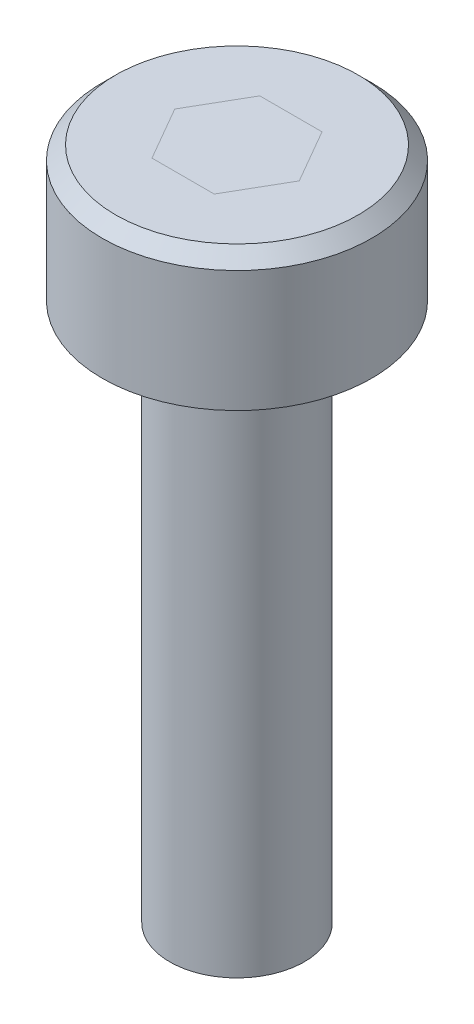
ISO-10303-21;
HEADER;
FILE_DESCRIPTION(('STEP AP214'),'2;1');
FILE_NAME('part.step','',(''),(''),'','','');
FILE_SCHEMA(('AUTOMOTIVE_DESIGN { 1 0 10303 214 1 1 1 1 }'));
ENDSEC;
DATA;
#1=APPLICATION_CONTEXT('core data for automotive mechanical design processes');
#2=APPLICATION_PROTOCOL_DEFINITION('international standard','automotive_design',2000,#1);
#3=PRODUCT_CONTEXT('',#1,'mechanical');
#4=PRODUCT('Part','Part','',(#3));
#5=PRODUCT_RELATED_PRODUCT_CATEGORY('part','',(#4));
#6=PRODUCT_DEFINITION_FORMATION('','',#4);
#7=PRODUCT_DEFINITION_CONTEXT('part definition',#1,'design');
#8=PRODUCT_DEFINITION('design','',#6,#7);
#9=PRODUCT_DEFINITION_SHAPE('','',#8);
#10=(LENGTH_UNIT() NAMED_UNIT(*) SI_UNIT(.MILLI.,.METRE.));
#11=(NAMED_UNIT(*) PLANE_ANGLE_UNIT() SI_UNIT($,.RADIAN.));
#12=(NAMED_UNIT(*) SI_UNIT($,.STERADIAN.) SOLID_ANGLE_UNIT());
#13=UNCERTAINTY_MEASURE_WITH_UNIT(LENGTH_MEASURE(1.E-05),#10,'distance_accuracy_value','');
#14=(GEOMETRIC_REPRESENTATION_CONTEXT(3) GLOBAL_UNCERTAINTY_ASSIGNED_CONTEXT((#13)) GLOBAL_UNIT_ASSIGNED_CONTEXT((#10,
#11,#12)) REPRESENTATION_CONTEXT('',''));
#15=CARTESIAN_POINT('',(0.,0.,0.));
#16=DIRECTION('',(0.,0.,1.));
#17=DIRECTION('',(1.,0.,0.));
#18=AXIS2_PLACEMENT_3D('',#15,#16,#17);
#19=CARTESIAN_POINT('',(0.,5.,0.));
#20=DIRECTION('',(0.,1.,0.));
#21=DIRECTION('',(0.,0.,1.));
#22=AXIS2_PLACEMENT_3D('',#19,#20,#21);
#23=PLANE('',#22);
#24=CARTESIAN_POINT('',(0.,5.,0.));
#25=DIRECTION('',(0.,1.,0.));
#26=DIRECTION('',(0.,0.,1.));
#27=AXIS2_PLACEMENT_3D('',#24,#25,#26);
#28=CIRCLE('',#27,4.5);
#29=CARTESIAN_POINT('',(0.,5.,4.5));
#30=VERTEX_POINT('',#29);
#31=EDGE_CURVE('E51',#30,#30,#28,.T.);
#32=ORIENTED_EDGE('',*,*,#31,.T.);
#33=EDGE_LOOP('',(#32));
#34=FACE_BOUND('',#33,.T.);
#35=DIRECTION('',(0.499999999999999,0.,-0.866025403784439));
#36=VECTOR('',#35,1.);
#37=CARTESIAN_POINT('',(-1.73205080756888,5.,-0.999999999999999));
#38=LINE('',#37,#36);
#39=CARTESIAN_POINT('',(-2.3094010767585,5.,0.));
#40=VERTEX_POINT('',#39);
#41=CARTESIAN_POINT('',(-1.15470053837925,5.,-2.));
#42=VERTEX_POINT('',#41);
#43=EDGE_CURVE('E62',#40,#42,#38,.T.);
#44=ORIENTED_EDGE('',*,*,#43,.T.);
#45=DIRECTION('',(1.,0.,0.));
#46=VECTOR('',#45,1.);
#47=CARTESIAN_POINT('',(0.,5.,-2.));
#48=LINE('',#47,#46);
#49=CARTESIAN_POINT('',(1.15470053837925,5.,-2.));
#50=VERTEX_POINT('',#49);
#51=EDGE_CURVE('E58',#42,#50,#48,.T.);
#52=ORIENTED_EDGE('',*,*,#51,.T.);
#53=DIRECTION('',(0.5,0.,0.866025403784439));
#54=VECTOR('',#53,1.);
#55=CARTESIAN_POINT('',(1.73205080756888,5.,-1.));
#56=LINE('',#55,#54);
#57=CARTESIAN_POINT('',(2.30940107675851,5.,0.));
#58=VERTEX_POINT('',#57);
#59=EDGE_CURVE('E76',#50,#58,#56,.T.);
#60=ORIENTED_EDGE('',*,*,#59,.T.);
#61=DIRECTION('',(-0.5,0.,0.866025403784438));
#62=VECTOR('',#61,1.);
#63=CARTESIAN_POINT('',(1.73205080756888,5.,1.));
#64=LINE('',#63,#62);
#65=CARTESIAN_POINT('',(1.15470053837925,5.,2.));
#66=VERTEX_POINT('',#65);
#67=EDGE_CURVE('E80',#58,#66,#64,.T.);
#68=ORIENTED_EDGE('',*,*,#67,.T.);
#69=DIRECTION('',(-1.,0.,0.));
#70=VECTOR('',#69,1.);
#71=CARTESIAN_POINT('',(0.,5.,2.));
#72=LINE('',#71,#70);
#73=CARTESIAN_POINT('',(-1.15470053837925,5.,2.00000000000001));
#74=VERTEX_POINT('',#73);
#75=EDGE_CURVE('E87',#66,#74,#72,.T.);
#76=ORIENTED_EDGE('',*,*,#75,.T.);
#77=DIRECTION('',(-0.5,0.,-0.866025403784439));
#78=VECTOR('',#77,1.);
#79=CARTESIAN_POINT('',(-1.73205080756888,5.,0.999999999999998));
#80=LINE('',#79,#78);
#81=EDGE_CURVE('E97',#74,#40,#80,.T.);
#82=ORIENTED_EDGE('',*,*,#81,.T.);
#83=EDGE_LOOP('',(#44,#52,#60,#68,#76,#82));
#84=FACE_BOUND('',#83,.T.);
#85=ADVANCED_FACE('F43',(#34,#84),#23,.T.);
#86=CARTESIAN_POINT('',(0.,5.,0.));
#87=DIRECTION('',(0.,-1.,0.));
#88=DIRECTION('',(0.,0.,-1.));
#89=AXIS2_PLACEMENT_3D('',#86,#87,#88);
#90=CYLINDRICAL_SURFACE('',#89,5.);
#91=CARTESIAN_POINT('',(0.,4.5,0.));
#92=DIRECTION('',(0.,1.,0.));
#93=DIRECTION('',(0.,0.,1.));
#94=AXIS2_PLACEMENT_3D('',#91,#92,#93);
#95=CIRCLE('',#94,5.);
#96=CARTESIAN_POINT('',(0.,4.5,5.));
#97=VERTEX_POINT('',#96);
#98=EDGE_CURVE('E11',#97,#97,#95,.F.);
#99=ORIENTED_EDGE('',*,*,#98,.T.);
#100=EDGE_LOOP('',(#99));
#101=FACE_BOUND('',#100,.T.);
#102=CARTESIAN_POINT('',(0.,0.,0.));
#103=DIRECTION('',(0.,1.,0.));
#104=DIRECTION('',(0.,0.,1.));
#105=AXIS2_PLACEMENT_3D('',#102,#103,#104);
#106=CIRCLE('',#105,5.);
#107=CARTESIAN_POINT('',(0.,0.,5.));
#108=VERTEX_POINT('',#107);
#109=EDGE_CURVE('E90',#108,#108,#106,.T.);
#110=ORIENTED_EDGE('',*,*,#109,.T.);
#111=EDGE_LOOP('',(#110));
#112=FACE_BOUND('',#111,.T.);
#113=ADVANCED_FACE('F116',(#101,#112),#90,.T.);
#114=ORIENTED_EDGE('',*,*,#51,.F.);
#115=ORIENTED_EDGE('',*,*,#43,.F.);
#116=ORIENTED_EDGE('',*,*,#81,.F.);
#117=ORIENTED_EDGE('',*,*,#75,.F.);
#118=ORIENTED_EDGE('',*,*,#67,.F.);
#119=ORIENTED_EDGE('',*,*,#59,.F.);
#120=EDGE_LOOP('',(#114,#115,#116,#117,#118,#119));
#121=FACE_BOUND('',#120,.T.);
#122=ADVANCED_FACE('F79',(#121),#23,.T.);
#123=CARTESIAN_POINT('',(0.,0.,0.));
#124=DIRECTION('',(0.,1.,0.));
#125=DIRECTION('',(0.,0.,1.));
#126=AXIS2_PLACEMENT_3D('',#123,#124,#125);
#127=PLANE('',#126);
#128=CARTESIAN_POINT('',(0.,0.,0.));
#129=DIRECTION('',(0.,-1.,0.));
#130=DIRECTION('',(0.,0.,-1.));
#131=AXIS2_PLACEMENT_3D('',#128,#129,#130);
#132=CIRCLE('',#131,2.5);
#133=CARTESIAN_POINT('',(0.,0.,-2.5));
#134=VERTEX_POINT('',#133);
#135=EDGE_CURVE('E82',#134,#134,#132,.T.);
#136=ORIENTED_EDGE('',*,*,#135,.F.);
#137=EDGE_LOOP('',(#136));
#138=FACE_BOUND('',#137,.T.);
#139=ORIENTED_EDGE('',*,*,#109,.F.);
#140=EDGE_LOOP('',(#139));
#141=FACE_BOUND('',#140,.T.);
#142=ADVANCED_FACE('F125',(#138,#141),#127,.F.);
#143=CARTESIAN_POINT('',(0.,-20.,0.));
#144=DIRECTION('',(0.,1.,0.));
#145=DIRECTION('',(0.,0.,1.));
#146=AXIS2_PLACEMENT_3D('',#143,#144,#145);
#147=CYLINDRICAL_SURFACE('',#146,2.5);
#148=CARTESIAN_POINT('',(0.,-20.,0.));
#149=DIRECTION('',(0.,-1.,0.));
#150=DIRECTION('',(0.,0.,-1.));
#151=AXIS2_PLACEMENT_3D('',#148,#149,#150);
#152=CIRCLE('',#151,2.5);
#153=CARTESIAN_POINT('',(0.,-20.,-2.5));
#154=VERTEX_POINT('',#153);
#155=EDGE_CURVE('E139',#154,#154,#152,.T.);
#156=ORIENTED_EDGE('',*,*,#155,.F.);
#157=EDGE_LOOP('',(#156));
#158=FACE_BOUND('',#157,.T.);
#159=ORIENTED_EDGE('',*,*,#135,.T.);
#160=EDGE_LOOP('',(#159));
#161=FACE_BOUND('',#160,.T.);
#162=ADVANCED_FACE('F111',(#158,#161),#147,.T.);
#163=CARTESIAN_POINT('',(0.,-20.,0.));
#164=DIRECTION('',(0.,-1.,0.));
#165=DIRECTION('',(0.,0.,-1.));
#166=AXIS2_PLACEMENT_3D('',#163,#164,#165);
#167=PLANE('',#166);
#168=ORIENTED_EDGE('',*,*,#155,.T.);
#169=EDGE_LOOP('',(#168));
#170=FACE_BOUND('',#169,.T.);
#171=ADVANCED_FACE('F106',(#170),#167,.T.);
#172=CARTESIAN_POINT('',(0.,5.,0.));
#173=DIRECTION('',(0.,-1.,0.));
#174=DIRECTION('',(0.,0.,-1.));
#175=AXIS2_PLACEMENT_3D('',#172,#173,#174);
#176=CONICAL_SURFACE('',#175,4.5,0.785398163397448);
#177=ORIENTED_EDGE('',*,*,#98,.F.);
#178=EDGE_LOOP('',(#177));
#179=FACE_BOUND('',#178,.T.);
#180=ORIENTED_EDGE('',*,*,#31,.F.);
#181=EDGE_LOOP('',(#180));
#182=FACE_BOUND('',#181,.T.);
#183=ADVANCED_FACE('F45',(#179,#182),#176,.T.);
#184=CLOSED_SHELL('',(#85,#113,#122,#142,#162,#171,#183));
#185=MANIFOLD_SOLID_BREP('B2',#184);
#186=ADVANCED_BREP_SHAPE_REPRESENTATION('',(#18,#185),#14);
#187=SHAPE_DEFINITION_REPRESENTATION(#9,#186);
ENDSEC;
END-ISO-10303-21;
